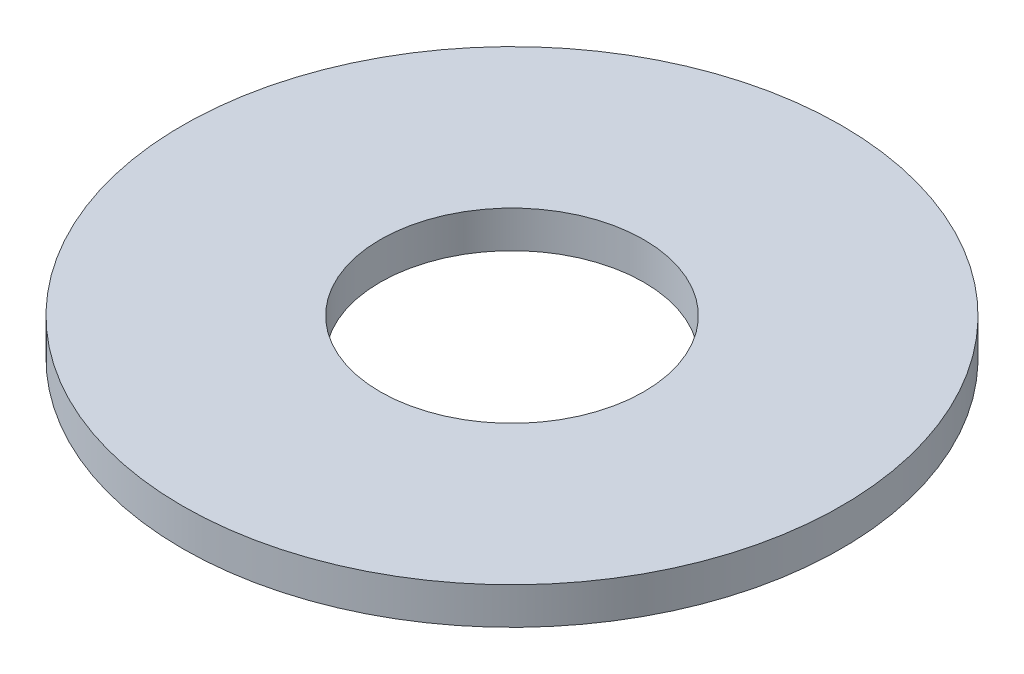
ISO-10303-21;
HEADER;
FILE_DESCRIPTION(('STEP AP214'),'2;1');
FILE_NAME('part.step','',(''),(''),'','','');
FILE_SCHEMA(('AUTOMOTIVE_DESIGN { 1 0 10303 214 1 1 1 1 }'));
ENDSEC;
DATA;
#1=APPLICATION_CONTEXT('core data for automotive mechanical design processes');
#2=APPLICATION_PROTOCOL_DEFINITION('international standard','automotive_design',2000,#1);
#3=PRODUCT_CONTEXT('',#1,'mechanical');
#4=PRODUCT('Part','Part','',(#3));
#5=PRODUCT_RELATED_PRODUCT_CATEGORY('part','',(#4));
#6=PRODUCT_DEFINITION_FORMATION('','',#4);
#7=PRODUCT_DEFINITION_CONTEXT('part definition',#1,'design');
#8=PRODUCT_DEFINITION('design','',#6,#7);
#9=PRODUCT_DEFINITION_SHAPE('','',#8);
#10=(LENGTH_UNIT() NAMED_UNIT(*) SI_UNIT(.MILLI.,.METRE.));
#11=(NAMED_UNIT(*) PLANE_ANGLE_UNIT() SI_UNIT($,.RADIAN.));
#12=(NAMED_UNIT(*) SI_UNIT($,.STERADIAN.) SOLID_ANGLE_UNIT());
#13=UNCERTAINTY_MEASURE_WITH_UNIT(LENGTH_MEASURE(1.E-05),#10,'distance_accuracy_value','');
#14=(GEOMETRIC_REPRESENTATION_CONTEXT(3) GLOBAL_UNCERTAINTY_ASSIGNED_CONTEXT((#13)) GLOBAL_UNIT_ASSIGNED_CONTEXT((#10,
#11,#12)) REPRESENTATION_CONTEXT('',''));
#15=CARTESIAN_POINT('',(0.,0.,0.));
#16=DIRECTION('',(0.,0.,1.));
#17=DIRECTION('',(1.,0.,0.));
#18=AXIS2_PLACEMENT_3D('',#15,#16,#17);
#19=CARTESIAN_POINT('',(0.,7.,0.));
#20=DIRECTION('',(0.,-1.,0.));
#21=DIRECTION('',(0.,0.,-1.));
#22=AXIS2_PLACEMENT_3D('',#19,#20,#21);
#23=CYLINDRICAL_SURFACE('',#22,62.5);
#24=CARTESIAN_POINT('',(0.,7.,0.));
#25=DIRECTION('',(0.,1.,0.));
#26=DIRECTION('',(0.,0.,1.));
#27=AXIS2_PLACEMENT_3D('',#24,#25,#26);
#28=CIRCLE('',#27,62.5);
#29=CARTESIAN_POINT('',(0.,7.,62.5));
#30=VERTEX_POINT('',#29);
#31=EDGE_CURVE('E10',#30,#30,#28,.T.);
#32=ORIENTED_EDGE('',*,*,#31,.F.);
#33=EDGE_LOOP('',(#32));
#34=FACE_BOUND('',#33,.T.);
#35=CARTESIAN_POINT('',(0.,0.,0.));
#36=DIRECTION('',(0.,1.,0.));
#37=DIRECTION('',(0.,0.,1.));
#38=AXIS2_PLACEMENT_3D('',#35,#36,#37);
#39=CIRCLE('',#38,62.5);
#40=CARTESIAN_POINT('',(0.,0.,62.5));
#41=VERTEX_POINT('',#40);
#42=EDGE_CURVE('E37',#41,#41,#39,.T.);
#43=ORIENTED_EDGE('',*,*,#42,.T.);
#44=EDGE_LOOP('',(#43));
#45=FACE_BOUND('',#44,.T.);
#46=ADVANCED_FACE('F40',(#34,#45),#23,.T.);
#47=CARTESIAN_POINT('',(0.,7.,0.));
#48=DIRECTION('',(0.,1.,0.));
#49=DIRECTION('',(0.,0.,1.));
#50=AXIS2_PLACEMENT_3D('',#47,#48,#49);
#51=PLANE('',#50);
#52=CARTESIAN_POINT('',(0.,7.,0.));
#53=DIRECTION('',(0.,1.,0.));
#54=DIRECTION('',(0.,0.,1.));
#55=AXIS2_PLACEMENT_3D('',#52,#53,#54);
#56=CIRCLE('',#55,25.);
#57=CARTESIAN_POINT('',(0.,7.,25.));
#58=VERTEX_POINT('',#57);
#59=EDGE_CURVE('E50',#58,#58,#56,.T.);
#60=ORIENTED_EDGE('',*,*,#59,.F.);
#61=EDGE_LOOP('',(#60));
#62=FACE_BOUND('',#61,.T.);
#63=ORIENTED_EDGE('',*,*,#31,.T.);
#64=EDGE_LOOP('',(#63));
#65=FACE_BOUND('',#64,.T.);
#66=ADVANCED_FACE('F59',(#62,#65),#51,.T.);
#67=CARTESIAN_POINT('',(0.,0.,0.));
#68=DIRECTION('',(0.,1.,0.));
#69=DIRECTION('',(0.,0.,1.));
#70=AXIS2_PLACEMENT_3D('',#67,#68,#69);
#71=PLANE('',#70);
#72=CARTESIAN_POINT('',(0.,0.,0.));
#73=DIRECTION('',(0.,1.,0.));
#74=DIRECTION('',(0.,0.,1.));
#75=AXIS2_PLACEMENT_3D('',#72,#73,#74);
#76=CIRCLE('',#75,25.);
#77=CARTESIAN_POINT('',(0.,0.,25.));
#78=VERTEX_POINT('',#77);
#79=EDGE_CURVE('E47',#78,#78,#76,.T.);
#80=ORIENTED_EDGE('',*,*,#79,.T.);
#81=EDGE_LOOP('',(#80));
#82=FACE_BOUND('',#81,.T.);
#83=ORIENTED_EDGE('',*,*,#42,.F.);
#84=EDGE_LOOP('',(#83));
#85=FACE_BOUND('',#84,.T.);
#86=ADVANCED_FACE('F58',(#82,#85),#71,.F.);
#87=CARTESIAN_POINT('',(0.,7.,0.));
#88=DIRECTION('',(0.,-1.,0.));
#89=DIRECTION('',(0.,0.,-1.));
#90=AXIS2_PLACEMENT_3D('',#87,#88,#89);
#91=CYLINDRICAL_SURFACE('',#90,25.);
#92=ORIENTED_EDGE('',*,*,#59,.T.);
#93=EDGE_LOOP('',(#92));
#94=FACE_BOUND('',#93,.T.);
#95=ORIENTED_EDGE('',*,*,#79,.F.);
#96=EDGE_LOOP('',(#95));
#97=FACE_BOUND('',#96,.T.);
#98=ADVANCED_FACE('F54',(#94,#97),#91,.F.);
#99=CLOSED_SHELL('',(#46,#66,#86,#98));
#100=MANIFOLD_SOLID_BREP('B2',#99);
#101=ADVANCED_BREP_SHAPE_REPRESENTATION('',(#18,#100),#14);
#102=SHAPE_DEFINITION_REPRESENTATION(#9,#101);
ENDSEC;
END-ISO-10303-21;
